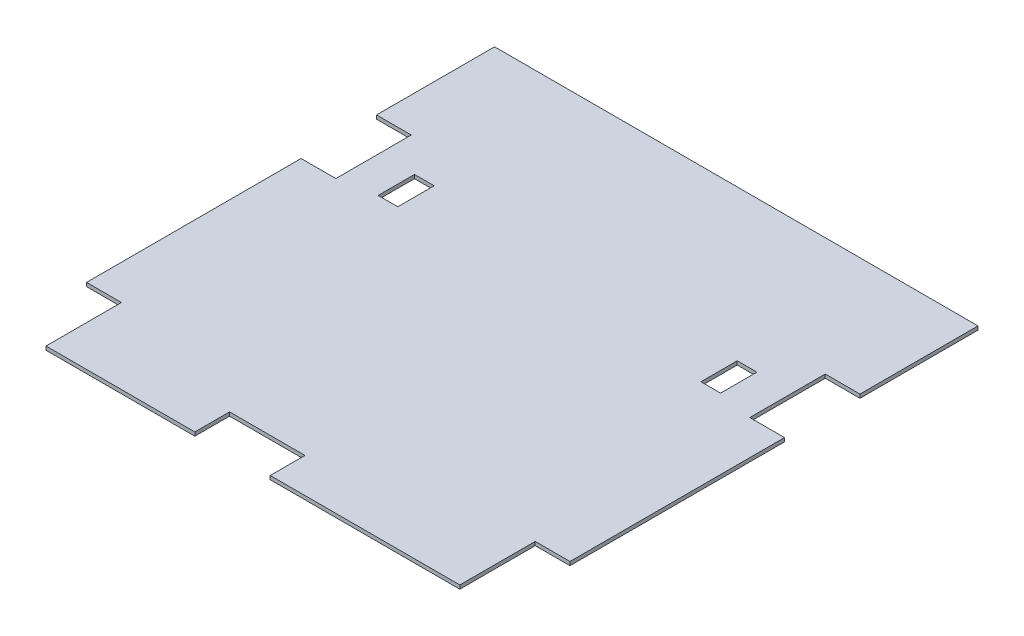
ISO-10303-21;
HEADER;
FILE_DESCRIPTION(('STEP AP214'),'2;1');
FILE_NAME('part.step','',(''),(''),'','','');
FILE_SCHEMA(('AUTOMOTIVE_DESIGN { 1 0 10303 214 1 1 1 1 }'));
ENDSEC;
DATA;
#1=APPLICATION_CONTEXT('core data for automotive mechanical design processes');
#2=APPLICATION_PROTOCOL_DEFINITION('international standard','automotive_design',2000,#1);
#3=PRODUCT_CONTEXT('',#1,'mechanical');
#4=PRODUCT('Part','Part','',(#3));
#5=PRODUCT_RELATED_PRODUCT_CATEGORY('part','',(#4));
#6=PRODUCT_DEFINITION_FORMATION('','',#4);
#7=PRODUCT_DEFINITION_CONTEXT('part definition',#1,'design');
#8=PRODUCT_DEFINITION('design','',#6,#7);
#9=PRODUCT_DEFINITION_SHAPE('','',#8);
#10=(LENGTH_UNIT() NAMED_UNIT(*) SI_UNIT(.MILLI.,.METRE.));
#11=(NAMED_UNIT(*) PLANE_ANGLE_UNIT() SI_UNIT($,.RADIAN.));
#12=(NAMED_UNIT(*) SI_UNIT($,.STERADIAN.) SOLID_ANGLE_UNIT());
#13=UNCERTAINTY_MEASURE_WITH_UNIT(LENGTH_MEASURE(1.E-05),#10,'distance_accuracy_value','');
#14=(GEOMETRIC_REPRESENTATION_CONTEXT(3) GLOBAL_UNCERTAINTY_ASSIGNED_CONTEXT((#13)) GLOBAL_UNIT_ASSIGNED_CONTEXT((#10,
#11,#12)) REPRESENTATION_CONTEXT('',''));
#15=CARTESIAN_POINT('',(0.,0.,0.));
#16=DIRECTION('',(0.,0.,1.));
#17=DIRECTION('',(1.,0.,0.));
#18=AXIS2_PLACEMENT_3D('',#15,#16,#17);
#19=CARTESIAN_POINT('',(0.,3.175,0.));
#20=DIRECTION('',(-1.,0.,0.));
#21=DIRECTION('',(0.,0.,1.));
#22=AXIS2_PLACEMENT_3D('',#19,#20,#21);
#23=PLANE('',#22);
#24=DIRECTION('',(0.,-1.,0.));
#25=VECTOR('',#24,1.);
#26=CARTESIAN_POINT('',(0.,3.175,-64.8999999999999));
#27=LINE('',#26,#25);
#28=CARTESIAN_POINT('',(0.,3.175,-64.8999999999999));
#29=VERTEX_POINT('',#28);
#30=CARTESIAN_POINT('',(0.,0.,-64.8999999999999));
#31=VERTEX_POINT('',#30);
#32=EDGE_CURVE('E315',#29,#31,#27,.T.);
#33=ORIENTED_EDGE('',*,*,#32,.F.);
#34=DIRECTION('',(0.,0.,-1.));
#35=VECTOR('',#34,1.);
#36=CARTESIAN_POINT('',(0.,3.175,0.));
#37=LINE('',#36,#35);
#38=CARTESIAN_POINT('',(0.,3.175,-249.58));
#39=VERTEX_POINT('',#38);
#40=EDGE_CURVE('E243',#29,#39,#37,.T.);
#41=ORIENTED_EDGE('',*,*,#40,.T.);
#42=DIRECTION('',(0.,-1.,0.));
#43=VECTOR('',#42,1.);
#44=CARTESIAN_POINT('',(0.,3.175,-249.58));
#45=LINE('',#44,#43);
#46=CARTESIAN_POINT('',(0.,0.,-249.58));
#47=VERTEX_POINT('',#46);
#48=EDGE_CURVE('E227',#39,#47,#45,.T.);
#49=ORIENTED_EDGE('',*,*,#48,.T.);
#50=DIRECTION('',(0.,0.,-1.));
#51=VECTOR('',#50,1.);
#52=CARTESIAN_POINT('',(0.,0.,0.));
#53=LINE('',#52,#51);
#54=EDGE_CURVE('E241',#31,#47,#53,.T.);
#55=ORIENTED_EDGE('',*,*,#54,.F.);
#56=EDGE_LOOP('',(#33,#41,#49,#55));
#57=FACE_BOUND('',#56,.T.);
#58=ADVANCED_FACE('F39',(#57),#23,.T.);
#59=CARTESIAN_POINT('',(0.,3.175,0.));
#60=DIRECTION('',(0.,0.,-1.));
#61=DIRECTION('',(-1.,0.,0.));
#62=AXIS2_PLACEMENT_3D('',#59,#60,#61);
#63=PLANE('',#62);
#64=DIRECTION('',(1.,0.,0.));
#65=VECTOR('',#64,1.);
#66=CARTESIAN_POINT('',(0.,0.,0.));
#67=LINE('',#66,#65);
#68=CARTESIAN_POINT('',(222.99,0.,0.));
#69=VERTEX_POINT('',#68);
#70=CARTESIAN_POINT('',(386.18,0.,0.));
#71=VERTEX_POINT('',#70);
#72=EDGE_CURVE('E260',#69,#71,#67,.T.);
#73=ORIENTED_EDGE('',*,*,#72,.T.);
#74=DIRECTION('',(0.,-1.,0.));
#75=VECTOR('',#74,1.);
#76=CARTESIAN_POINT('',(386.18,3.175,0.));
#77=LINE('',#76,#75);
#78=CARTESIAN_POINT('',(386.18,3.175,0.));
#79=VERTEX_POINT('',#78);
#80=EDGE_CURVE('E359',#79,#71,#77,.T.);
#81=ORIENTED_EDGE('',*,*,#80,.F.);
#82=DIRECTION('',(1.,0.,0.));
#83=VECTOR('',#82,1.);
#84=CARTESIAN_POINT('',(0.,3.175,0.));
#85=LINE('',#84,#83);
#86=CARTESIAN_POINT('',(222.99,3.175,0.));
#87=VERTEX_POINT('',#86);
#88=EDGE_CURVE('E273',#87,#79,#85,.T.);
#89=ORIENTED_EDGE('',*,*,#88,.F.);
#90=DIRECTION('',(0.,-1.,0.));
#91=VECTOR('',#90,1.);
#92=CARTESIAN_POINT('',(222.99,3.175,0.));
#93=LINE('',#92,#91);
#94=EDGE_CURVE('E336',#87,#69,#93,.T.);
#95=ORIENTED_EDGE('',*,*,#94,.T.);
#96=EDGE_LOOP('',(#73,#81,#89,#95));
#97=FACE_BOUND('',#96,.T.);
#98=ADVANCED_FACE('F484',(#97),#63,.F.);
#99=CARTESIAN_POINT('',(416.08,3.175,0.));
#100=DIRECTION('',(-1.,0.,0.));
#101=DIRECTION('',(0.,0.,1.));
#102=AXIS2_PLACEMENT_3D('',#99,#100,#101);
#103=PLANE('',#102);
#104=DIRECTION('',(0.,0.,-1.));
#105=VECTOR('',#104,1.);
#106=CARTESIAN_POINT('',(416.08,3.175,0.));
#107=LINE('',#106,#105);
#108=CARTESIAN_POINT('',(416.08,3.175,-314.48));
#109=VERTEX_POINT('',#108);
#110=CARTESIAN_POINT('',(416.08,3.175,-416.08));
#111=VERTEX_POINT('',#110);
#112=EDGE_CURVE('E256',#109,#111,#107,.T.);
#113=ORIENTED_EDGE('',*,*,#112,.F.);
#114=DIRECTION('',(0.,-1.,0.));
#115=VECTOR('',#114,1.);
#116=CARTESIAN_POINT('',(416.08,3.175,-314.48));
#117=LINE('',#116,#115);
#118=CARTESIAN_POINT('',(416.08,0.,-314.48));
#119=VERTEX_POINT('',#118);
#120=EDGE_CURVE('E415',#109,#119,#117,.T.);
#121=ORIENTED_EDGE('',*,*,#120,.T.);
#122=DIRECTION('',(0.,0.,-1.));
#123=VECTOR('',#122,1.);
#124=CARTESIAN_POINT('',(416.08,0.,0.));
#125=LINE('',#124,#123);
#126=CARTESIAN_POINT('',(416.08,0.,-416.08));
#127=VERTEX_POINT('',#126);
#128=EDGE_CURVE('E264',#119,#127,#125,.T.);
#129=ORIENTED_EDGE('',*,*,#128,.T.);
#130=DIRECTION('',(0.,-1.,0.));
#131=VECTOR('',#130,1.);
#132=CARTESIAN_POINT('',(416.08,3.175,-416.08));
#133=LINE('',#132,#131);
#134=EDGE_CURVE('E43',#111,#127,#133,.T.);
#135=ORIENTED_EDGE('',*,*,#134,.F.);
#136=EDGE_LOOP('',(#113,#121,#129,#135));
#137=FACE_BOUND('',#136,.T.);
#138=ADVANCED_FACE('F456',(#137),#103,.F.);
#139=CARTESIAN_POINT('',(0.,3.175,-416.08));
#140=DIRECTION('',(0.,0.,-1.));
#141=DIRECTION('',(-1.,0.,0.));
#142=AXIS2_PLACEMENT_3D('',#139,#140,#141);
#143=PLANE('',#142);
#144=DIRECTION('',(1.,0.,0.));
#145=VECTOR('',#144,1.);
#146=CARTESIAN_POINT('',(0.,0.,-416.08));
#147=LINE('',#146,#145);
#148=CARTESIAN_POINT('',(0.,0.,-416.08));
#149=VERTEX_POINT('',#148);
#150=EDGE_CURVE('E266',#149,#127,#147,.T.);
#151=ORIENTED_EDGE('',*,*,#150,.F.);
#152=DIRECTION('',(0.,-1.,0.));
#153=VECTOR('',#152,1.);
#154=CARTESIAN_POINT('',(0.,3.175,-416.08));
#155=LINE('',#154,#153);
#156=CARTESIAN_POINT('',(0.,3.175,-416.08));
#157=VERTEX_POINT('',#156);
#158=EDGE_CURVE('E11',#157,#149,#155,.T.);
#159=ORIENTED_EDGE('',*,*,#158,.F.);
#160=DIRECTION('',(1.,0.,0.));
#161=VECTOR('',#160,1.);
#162=CARTESIAN_POINT('',(0.,3.175,-416.08));
#163=LINE('',#162,#161);
#164=EDGE_CURVE('E252',#157,#111,#163,.T.);
#165=ORIENTED_EDGE('',*,*,#164,.T.);
#166=ORIENTED_EDGE('',*,*,#134,.T.);
#167=EDGE_LOOP('',(#151,#159,#165,#166));
#168=FACE_BOUND('',#167,.T.);
#169=ADVANCED_FACE('F41',(#168),#143,.T.);
#170=DIRECTION('',(0.,-1.,0.));
#171=VECTOR('',#170,1.);
#172=CARTESIAN_POINT('',(0.,3.175,-314.48));
#173=LINE('',#172,#171);
#174=CARTESIAN_POINT('',(0.,3.175,-314.48));
#175=VERTEX_POINT('',#174);
#176=CARTESIAN_POINT('',(0.,0.,-314.48));
#177=VERTEX_POINT('',#176);
#178=EDGE_CURVE('E430',#175,#177,#173,.T.);
#179=ORIENTED_EDGE('',*,*,#178,.F.);
#180=EDGE_CURVE('E270',#175,#157,#37,.T.);
#181=ORIENTED_EDGE('',*,*,#180,.T.);
#182=ORIENTED_EDGE('',*,*,#158,.T.);
#183=EDGE_CURVE('E253',#177,#149,#53,.T.);
#184=ORIENTED_EDGE('',*,*,#183,.F.);
#185=EDGE_LOOP('',(#179,#181,#182,#184));
#186=FACE_BOUND('',#185,.T.);
#187=ADVANCED_FACE('F444',(#186),#23,.T.);
#188=CARTESIAN_POINT('',(30.,0.,0.));
#189=VERTEX_POINT('',#188);
#190=CARTESIAN_POINT('',(158.09,0.,0.));
#191=VERTEX_POINT('',#190);
#192=EDGE_CURVE('E258',#189,#191,#67,.T.);
#193=ORIENTED_EDGE('',*,*,#192,.T.);
#194=DIRECTION('',(0.,-1.,0.));
#195=VECTOR('',#194,1.);
#196=CARTESIAN_POINT('',(158.09,3.175,0.));
#197=LINE('',#196,#195);
#198=CARTESIAN_POINT('',(158.09,3.175,0.));
#199=VERTEX_POINT('',#198);
#200=EDGE_CURVE('E348',#199,#191,#197,.T.);
#201=ORIENTED_EDGE('',*,*,#200,.F.);
#202=CARTESIAN_POINT('',(30.,3.175,0.));
#203=VERTEX_POINT('',#202);
#204=EDGE_CURVE('E272',#203,#199,#85,.T.);
#205=ORIENTED_EDGE('',*,*,#204,.F.);
#206=DIRECTION('',(0.,-1.,0.));
#207=VECTOR('',#206,1.);
#208=CARTESIAN_POINT('',(30.,3.175,0.));
#209=LINE('',#208,#207);
#210=EDGE_CURVE('E319',#203,#189,#209,.T.);
#211=ORIENTED_EDGE('',*,*,#210,.T.);
#212=EDGE_LOOP('',(#193,#201,#205,#211));
#213=FACE_BOUND('',#212,.T.);
#214=ADVANCED_FACE('F501',(#213),#63,.F.);
#215=CARTESIAN_POINT('',(416.08,3.175,-64.8999999999999));
#216=VERTEX_POINT('',#215);
#217=CARTESIAN_POINT('',(416.08,3.175,-249.58));
#218=VERTEX_POINT('',#217);
#219=EDGE_CURVE('E276',#216,#218,#107,.T.);
#220=ORIENTED_EDGE('',*,*,#219,.F.);
#221=DIRECTION('',(0.,-1.,0.));
#222=VECTOR('',#221,1.);
#223=CARTESIAN_POINT('',(416.08,3.175,-64.8999999999999));
#224=LINE('',#223,#222);
#225=CARTESIAN_POINT('',(416.08,0.,-64.8999999999999));
#226=VERTEX_POINT('',#225);
#227=EDGE_CURVE('E339',#216,#226,#224,.T.);
#228=ORIENTED_EDGE('',*,*,#227,.T.);
#229=CARTESIAN_POINT('',(416.08,0.,-249.58));
#230=VERTEX_POINT('',#229);
#231=EDGE_CURVE('E263',#226,#230,#125,.T.);
#232=ORIENTED_EDGE('',*,*,#231,.T.);
#233=DIRECTION('',(0.,-1.,0.));
#234=VECTOR('',#233,1.);
#235=CARTESIAN_POINT('',(416.08,3.175,-249.58));
#236=LINE('',#235,#234);
#237=EDGE_CURVE('E408',#218,#230,#236,.T.);
#238=ORIENTED_EDGE('',*,*,#237,.F.);
#239=EDGE_LOOP('',(#220,#228,#232,#238));
#240=FACE_BOUND('',#239,.T.);
#241=ADVANCED_FACE('F474',(#240),#103,.F.);
#242=CARTESIAN_POINT('',(0.,3.175,0.));
#243=DIRECTION('',(0.,1.,0.));
#244=DIRECTION('',(0.,0.,1.));
#245=AXIS2_PLACEMENT_3D('',#242,#243,#244);
#246=PLANE('',#245);
#247=DIRECTION('',(0.,0.,1.));
#248=VECTOR('',#247,1.);
#249=CARTESIAN_POINT('',(355.398114974862,3.175,-255.205234024173));
#250=LINE('',#249,#248);
#251=CARTESIAN_POINT('',(355.398114974862,3.175,-286.464232730795));
#252=VERTEX_POINT('',#251);
#253=CARTESIAN_POINT('',(355.398114974862,3.175,-255.205234024173));
#254=VERTEX_POINT('',#253);
#255=EDGE_CURVE('E370',#252,#254,#250,.T.);
#256=ORIENTED_EDGE('',*,*,#255,.T.);
#257=DIRECTION('',(-1.,0.,0.));
#258=VECTOR('',#257,1.);
#259=CARTESIAN_POINT('',(355.398114974862,3.175,-255.205234024173));
#260=LINE('',#259,#258);
#261=CARTESIAN_POINT('',(338.483807993559,3.175,-255.205234024173));
#262=VERTEX_POINT('',#261);
#263=EDGE_CURVE('E374',#254,#262,#260,.T.);
#264=ORIENTED_EDGE('',*,*,#263,.T.);
#265=DIRECTION('',(0.,0.,-1.));
#266=VECTOR('',#265,1.);
#267=CARTESIAN_POINT('',(338.483807993559,3.175,-255.205234024173));
#268=LINE('',#267,#266);
#269=CARTESIAN_POINT('',(338.483807993559,3.175,-286.464232730795));
#270=VERTEX_POINT('',#269);
#271=EDGE_CURVE('E54',#262,#270,#268,.T.);
#272=ORIENTED_EDGE('',*,*,#271,.T.);
#273=DIRECTION('',(1.,0.,0.));
#274=VECTOR('',#273,1.);
#275=CARTESIAN_POINT('',(355.398114974862,3.175,-286.464232730795));
#276=LINE('',#275,#274);
#277=EDGE_CURVE('E378',#270,#252,#276,.T.);
#278=ORIENTED_EDGE('',*,*,#277,.T.);
#279=EDGE_LOOP('',(#256,#264,#272,#278));
#280=FACE_BOUND('',#279,.T.);
#281=DIRECTION('',(1.,0.,0.));
#282=VECTOR('',#281,1.);
#283=CARTESIAN_POINT('',(416.08,3.175,-64.8999999999999));
#284=LINE('',#283,#282);
#285=CARTESIAN_POINT('',(386.18,3.175,-64.8999999999999));
#286=VERTEX_POINT('',#285);
#287=EDGE_CURVE('E356',#286,#216,#284,.T.);
#288=ORIENTED_EDGE('',*,*,#287,.T.);
#289=ORIENTED_EDGE('',*,*,#219,.T.);
#290=DIRECTION('',(-1.,0.,0.));
#291=VECTOR('',#290,1.);
#292=CARTESIAN_POINT('',(416.08,3.175,-249.58));
#293=LINE('',#292,#291);
#294=CARTESIAN_POINT('',(386.18,3.175,-249.58));
#295=VERTEX_POINT('',#294);
#296=EDGE_CURVE('E398',#218,#295,#293,.T.);
#297=ORIENTED_EDGE('',*,*,#296,.T.);
#298=DIRECTION('',(0.,0.,-1.));
#299=VECTOR('',#298,1.);
#300=CARTESIAN_POINT('',(386.18,3.175,-249.58));
#301=LINE('',#300,#299);
#302=CARTESIAN_POINT('',(386.18,3.175,-314.48));
#303=VERTEX_POINT('',#302);
#304=EDGE_CURVE('E402',#295,#303,#301,.T.);
#305=ORIENTED_EDGE('',*,*,#304,.T.);
#306=DIRECTION('',(1.,0.,0.));
#307=VECTOR('',#306,1.);
#308=CARTESIAN_POINT('',(416.08,3.175,-314.48));
#309=LINE('',#308,#307);
#310=EDGE_CURVE('E405',#303,#109,#309,.T.);
#311=ORIENTED_EDGE('',*,*,#310,.T.);
#312=ORIENTED_EDGE('',*,*,#112,.T.);
#313=ORIENTED_EDGE('',*,*,#164,.F.);
#314=ORIENTED_EDGE('',*,*,#180,.F.);
#315=DIRECTION('',(1.,0.,0.));
#316=VECTOR('',#315,1.);
#317=CARTESIAN_POINT('',(0.,3.175,-314.48));
#318=LINE('',#317,#316);
#319=CARTESIAN_POINT('',(29.9,3.175,-314.48));
#320=VERTEX_POINT('',#319);
#321=EDGE_CURVE('E235',#175,#320,#318,.T.);
#322=ORIENTED_EDGE('',*,*,#321,.T.);
#323=DIRECTION('',(0.,0.,1.));
#324=VECTOR('',#323,1.);
#325=CARTESIAN_POINT('',(29.9,3.175,-314.48));
#326=LINE('',#325,#324);
#327=CARTESIAN_POINT('',(29.9,3.175,-249.58));
#328=VERTEX_POINT('',#327);
#329=EDGE_CURVE('E425',#320,#328,#326,.T.);
#330=ORIENTED_EDGE('',*,*,#329,.T.);
#331=DIRECTION('',(-1.,0.,0.));
#332=VECTOR('',#331,1.);
#333=CARTESIAN_POINT('',(0.,3.175,-249.58));
#334=LINE('',#333,#332);
#335=EDGE_CURVE('E428',#328,#39,#334,.T.);
#336=ORIENTED_EDGE('',*,*,#335,.T.);
#337=ORIENTED_EDGE('',*,*,#40,.F.);
#338=DIRECTION('',(1.,0.,0.));
#339=VECTOR('',#338,1.);
#340=CARTESIAN_POINT('',(0.,3.175,-64.8999999999999));
#341=LINE('',#340,#339);
#342=CARTESIAN_POINT('',(30.,3.175,-64.8999999999999));
#343=VERTEX_POINT('',#342);
#344=EDGE_CURVE('E308',#29,#343,#341,.T.);
#345=ORIENTED_EDGE('',*,*,#344,.T.);
#346=DIRECTION('',(0.,0.,1.));
#347=VECTOR('',#346,1.);
#348=CARTESIAN_POINT('',(30.,3.175,0.));
#349=LINE('',#348,#347);
#350=EDGE_CURVE('E312',#343,#203,#349,.T.);
#351=ORIENTED_EDGE('',*,*,#350,.T.);
#352=ORIENTED_EDGE('',*,*,#204,.T.);
#353=DIRECTION('',(0.,0.,-1.));
#354=VECTOR('',#353,1.);
#355=CARTESIAN_POINT('',(158.09,3.175,-29.9));
#356=LINE('',#355,#354);
#357=CARTESIAN_POINT('',(158.09,3.175,-29.9));
#358=VERTEX_POINT('',#357);
#359=EDGE_CURVE('E330',#199,#358,#356,.T.);
#360=ORIENTED_EDGE('',*,*,#359,.T.);
#361=DIRECTION('',(1.,0.,0.));
#362=VECTOR('',#361,1.);
#363=CARTESIAN_POINT('',(222.99,3.175,-29.9));
#364=LINE('',#363,#362);
#365=CARTESIAN_POINT('',(222.99,3.175,-29.9));
#366=VERTEX_POINT('',#365);
#367=EDGE_CURVE('E333',#358,#366,#364,.T.);
#368=ORIENTED_EDGE('',*,*,#367,.T.);
#369=DIRECTION('',(0.,0.,1.));
#370=VECTOR('',#369,1.);
#371=CARTESIAN_POINT('',(222.99,3.175,-29.9));
#372=LINE('',#371,#370);
#373=EDGE_CURVE('E326',#366,#87,#372,.T.);
#374=ORIENTED_EDGE('',*,*,#373,.T.);
#375=ORIENTED_EDGE('',*,*,#88,.T.);
#376=DIRECTION('',(0.,0.,-1.));
#377=VECTOR('',#376,1.);
#378=CARTESIAN_POINT('',(386.18,3.175,0.));
#379=LINE('',#378,#377);
#380=EDGE_CURVE('E352',#79,#286,#379,.T.);
#381=ORIENTED_EDGE('',*,*,#380,.T.);
#382=EDGE_LOOP('',(#288,#289,#297,#305,#311,#312,#313,#314,#322,#330,#336,#337,#345,#351,#352,
#360,#368,#374,#375,#381));
#383=FACE_BOUND('',#382,.T.);
#384=DIRECTION('',(0.,0.,1.));
#385=VECTOR('',#384,1.);
#386=CARTESIAN_POINT('',(77.5961920064408,3.175,-255.205234024173));
#387=LINE('',#386,#385);
#388=CARTESIAN_POINT('',(77.5961920064408,3.175,-286.464232730795));
#389=VERTEX_POINT('',#388);
#390=CARTESIAN_POINT('',(77.5961920064408,3.175,-255.205234024173));
#391=VERTEX_POINT('',#390);
#392=EDGE_CURVE('E290',#389,#391,#387,.T.);
#393=ORIENTED_EDGE('',*,*,#392,.T.);
#394=DIRECTION('',(-1.,0.,0.));
#395=VECTOR('',#394,1.);
#396=CARTESIAN_POINT('',(60.6818850251383,3.175,-255.205234024173));
#397=LINE('',#396,#395);
#398=CARTESIAN_POINT('',(60.6818850251383,3.175,-255.205234024173));
#399=VERTEX_POINT('',#398);
#400=EDGE_CURVE('E303',#391,#399,#397,.T.);
#401=ORIENTED_EDGE('',*,*,#400,.T.);
#402=DIRECTION('',(0.,0.,-1.));
#403=VECTOR('',#402,1.);
#404=CARTESIAN_POINT('',(60.6818850251383,3.175,-255.205234024173));
#405=LINE('',#404,#403);
#406=CARTESIAN_POINT('',(60.6818850251383,3.175,-286.464232730795));
#407=VERTEX_POINT('',#406);
#408=EDGE_CURVE('E62',#399,#407,#405,.T.);
#409=ORIENTED_EDGE('',*,*,#408,.T.);
#410=DIRECTION('',(1.,0.,0.));
#411=VECTOR('',#410,1.);
#412=CARTESIAN_POINT('',(60.6818850251383,3.175,-286.464232730795));
#413=LINE('',#412,#411);
#414=EDGE_CURVE('E282',#407,#389,#413,.T.);
#415=ORIENTED_EDGE('',*,*,#414,.T.);
#416=EDGE_LOOP('',(#393,#401,#409,#415));
#417=FACE_BOUND('',#416,.T.);
#418=ADVANCED_FACE('F461',(#280,#383,#417),#246,.T.);
#419=CARTESIAN_POINT('',(0.,0.,0.));
#420=DIRECTION('',(0.,1.,0.));
#421=DIRECTION('',(0.,0.,1.));
#422=AXIS2_PLACEMENT_3D('',#419,#420,#421);
#423=PLANE('',#422);
#424=DIRECTION('',(-1.,0.,0.));
#425=VECTOR('',#424,1.);
#426=CARTESIAN_POINT('',(355.398114974862,0.,-255.205234024173));
#427=LINE('',#426,#425);
#428=CARTESIAN_POINT('',(355.398114974862,0.,-255.205234024173));
#429=VERTEX_POINT('',#428);
#430=CARTESIAN_POINT('',(338.483807993559,0.,-255.205234024173));
#431=VERTEX_POINT('',#430);
#432=EDGE_CURVE('E383',#429,#431,#427,.T.);
#433=ORIENTED_EDGE('',*,*,#432,.F.);
#434=DIRECTION('',(0.,0.,1.));
#435=VECTOR('',#434,1.);
#436=CARTESIAN_POINT('',(355.398114974862,0.,-255.205234024173));
#437=LINE('',#436,#435);
#438=CARTESIAN_POINT('',(355.398114974862,0.,-286.464232730795));
#439=VERTEX_POINT('',#438);
#440=EDGE_CURVE('E299',#439,#429,#437,.T.);
#441=ORIENTED_EDGE('',*,*,#440,.F.);
#442=DIRECTION('',(1.,0.,0.));
#443=VECTOR('',#442,1.);
#444=CARTESIAN_POINT('',(355.398114974862,0.,-286.464232730795));
#445=LINE('',#444,#443);
#446=CARTESIAN_POINT('',(338.483807993559,0.,-286.464232730795));
#447=VERTEX_POINT('',#446);
#448=EDGE_CURVE('E373',#447,#439,#445,.T.);
#449=ORIENTED_EDGE('',*,*,#448,.F.);
#450=DIRECTION('',(0.,0.,-1.));
#451=VECTOR('',#450,1.);
#452=CARTESIAN_POINT('',(338.483807993559,0.,-255.205234024173));
#453=LINE('',#452,#451);
#454=EDGE_CURVE('E386',#431,#447,#453,.T.);
#455=ORIENTED_EDGE('',*,*,#454,.F.);
#456=EDGE_LOOP('',(#433,#441,#449,#455));
#457=FACE_BOUND('',#456,.T.);
#458=DIRECTION('',(-1.,0.,0.));
#459=VECTOR('',#458,1.);
#460=CARTESIAN_POINT('',(60.6818850251383,0.,-255.205234024173));
#461=LINE('',#460,#459);
#462=CARTESIAN_POINT('',(77.5961920064408,0.,-255.205234024173));
#463=VERTEX_POINT('',#462);
#464=CARTESIAN_POINT('',(60.6818850251383,0.,-255.205234024173));
#465=VERTEX_POINT('',#464);
#466=EDGE_CURVE('E294',#463,#465,#461,.T.);
#467=ORIENTED_EDGE('',*,*,#466,.F.);
#468=DIRECTION('',(0.,0.,1.));
#469=VECTOR('',#468,1.);
#470=CARTESIAN_POINT('',(77.5961920064408,0.,-255.205234024173));
#471=LINE('',#470,#469);
#472=CARTESIAN_POINT('',(77.5961920064408,0.,-286.464232730795));
#473=VERTEX_POINT('',#472);
#474=EDGE_CURVE('E297',#473,#463,#471,.T.);
#475=ORIENTED_EDGE('',*,*,#474,.F.);
#476=DIRECTION('',(1.,0.,0.));
#477=VECTOR('',#476,1.);
#478=CARTESIAN_POINT('',(60.6818850251383,0.,-286.464232730795));
#479=LINE('',#478,#477);
#480=CARTESIAN_POINT('',(60.6818850251383,0.,-286.464232730795));
#481=VERTEX_POINT('',#480);
#482=EDGE_CURVE('E287',#481,#473,#479,.T.);
#483=ORIENTED_EDGE('',*,*,#482,.F.);
#484=DIRECTION('',(0.,0.,-1.));
#485=VECTOR('',#484,1.);
#486=CARTESIAN_POINT('',(60.6818850251383,0.,-255.205234024173));
#487=LINE('',#486,#485);
#488=EDGE_CURVE('E291',#465,#481,#487,.T.);
#489=ORIENTED_EDGE('',*,*,#488,.F.);
#490=EDGE_LOOP('',(#467,#475,#483,#489));
#491=FACE_BOUND('',#490,.T.);
#492=ORIENTED_EDGE('',*,*,#231,.F.);
#493=DIRECTION('',(1.,0.,0.));
#494=VECTOR('',#493,1.);
#495=CARTESIAN_POINT('',(416.08,0.,-64.8999999999999));
#496=LINE('',#495,#494);
#497=CARTESIAN_POINT('',(386.18,0.,-64.8999999999999));
#498=VERTEX_POINT('',#497);
#499=EDGE_CURVE('E355',#498,#226,#496,.T.);
#500=ORIENTED_EDGE('',*,*,#499,.F.);
#501=DIRECTION('',(0.,0.,-1.));
#502=VECTOR('',#501,1.);
#503=CARTESIAN_POINT('',(386.18,0.,0.));
#504=LINE('',#503,#502);
#505=EDGE_CURVE('E360',#71,#498,#504,.T.);
#506=ORIENTED_EDGE('',*,*,#505,.F.);
#507=ORIENTED_EDGE('',*,*,#72,.F.);
#508=DIRECTION('',(0.,0.,1.));
#509=VECTOR('',#508,1.);
#510=CARTESIAN_POINT('',(222.99,0.,-29.9));
#511=LINE('',#510,#509);
#512=CARTESIAN_POINT('',(222.99,0.,-29.9));
#513=VERTEX_POINT('',#512);
#514=EDGE_CURVE('E337',#513,#69,#511,.T.);
#515=ORIENTED_EDGE('',*,*,#514,.F.);
#516=DIRECTION('',(1.,0.,0.));
#517=VECTOR('',#516,1.);
#518=CARTESIAN_POINT('',(222.99,0.,-29.9));
#519=LINE('',#518,#517);
#520=CARTESIAN_POINT('',(158.09,0.,-29.9));
#521=VERTEX_POINT('',#520);
#522=EDGE_CURVE('E329',#521,#513,#519,.T.);
#523=ORIENTED_EDGE('',*,*,#522,.F.);
#524=DIRECTION('',(0.,0.,-1.));
#525=VECTOR('',#524,1.);
#526=CARTESIAN_POINT('',(158.09,0.,-29.9));
#527=LINE('',#526,#525);
#528=EDGE_CURVE('E340',#191,#521,#527,.T.);
#529=ORIENTED_EDGE('',*,*,#528,.F.);
#530=ORIENTED_EDGE('',*,*,#192,.F.);
#531=DIRECTION('',(0.,0.,1.));
#532=VECTOR('',#531,1.);
#533=CARTESIAN_POINT('',(30.,0.,0.));
#534=LINE('',#533,#532);
#535=CARTESIAN_POINT('',(30.,0.,-64.8999999999999));
#536=VERTEX_POINT('',#535);
#537=EDGE_CURVE('E311',#536,#189,#534,.T.);
#538=ORIENTED_EDGE('',*,*,#537,.F.);
#539=DIRECTION('',(1.,0.,0.));
#540=VECTOR('',#539,1.);
#541=CARTESIAN_POINT('',(0.,0.,-64.8999999999999));
#542=LINE('',#541,#540);
#543=EDGE_CURVE('E251',#31,#536,#542,.T.);
#544=ORIENTED_EDGE('',*,*,#543,.F.);
#545=ORIENTED_EDGE('',*,*,#54,.T.);
#546=DIRECTION('',(-1.,0.,0.));
#547=VECTOR('',#546,1.);
#548=CARTESIAN_POINT('',(0.,0.,-249.58));
#549=LINE('',#548,#547);
#550=CARTESIAN_POINT('',(29.9,0.,-249.58));
#551=VERTEX_POINT('',#550);
#552=EDGE_CURVE('E223',#551,#47,#549,.T.);
#553=ORIENTED_EDGE('',*,*,#552,.F.);
#554=DIRECTION('',(0.,0.,1.));
#555=VECTOR('',#554,1.);
#556=CARTESIAN_POINT('',(29.9,0.,-314.48));
#557=LINE('',#556,#555);
#558=CARTESIAN_POINT('',(29.9,0.,-314.48));
#559=VERTEX_POINT('',#558);
#560=EDGE_CURVE('E234',#559,#551,#557,.T.);
#561=ORIENTED_EDGE('',*,*,#560,.F.);
#562=DIRECTION('',(1.,0.,0.));
#563=VECTOR('',#562,1.);
#564=CARTESIAN_POINT('',(0.,0.,-314.48));
#565=LINE('',#564,#563);
#566=EDGE_CURVE('E323',#177,#559,#565,.T.);
#567=ORIENTED_EDGE('',*,*,#566,.F.);
#568=ORIENTED_EDGE('',*,*,#183,.T.);
#569=ORIENTED_EDGE('',*,*,#150,.T.);
#570=ORIENTED_EDGE('',*,*,#128,.F.);
#571=DIRECTION('',(1.,0.,0.));
#572=VECTOR('',#571,1.);
#573=CARTESIAN_POINT('',(416.08,0.,-314.48));
#574=LINE('',#573,#572);
#575=CARTESIAN_POINT('',(386.18,0.,-314.48));
#576=VERTEX_POINT('',#575);
#577=EDGE_CURVE('E401',#576,#119,#574,.T.);
#578=ORIENTED_EDGE('',*,*,#577,.F.);
#579=DIRECTION('',(0.,0.,-1.));
#580=VECTOR('',#579,1.);
#581=CARTESIAN_POINT('',(386.18,0.,-249.58));
#582=LINE('',#581,#580);
#583=CARTESIAN_POINT('',(386.18,0.,-249.58));
#584=VERTEX_POINT('',#583);
#585=EDGE_CURVE('E411',#584,#576,#582,.T.);
#586=ORIENTED_EDGE('',*,*,#585,.F.);
#587=DIRECTION('',(-1.,0.,0.));
#588=VECTOR('',#587,1.);
#589=CARTESIAN_POINT('',(416.08,0.,-249.58));
#590=LINE('',#589,#588);
#591=EDGE_CURVE('E244',#230,#584,#590,.T.);
#592=ORIENTED_EDGE('',*,*,#591,.F.);
#593=EDGE_LOOP('',(#492,#500,#506,#507,#515,#523,#529,#530,#538,#544,#545,#553,#561,#567,#568,
#569,#570,#578,#586,#592));
#594=FACE_BOUND('',#593,.T.);
#595=ADVANCED_FACE('F248',(#457,#491,#594),#423,.F.);
#596=CARTESIAN_POINT('',(77.5961920064408,3.175,-255.205234024173));
#597=DIRECTION('',(1.,0.,0.));
#598=DIRECTION('',(0.,0.,-1.));
#599=AXIS2_PLACEMENT_3D('',#596,#597,#598);
#600=PLANE('',#599);
#601=ORIENTED_EDGE('',*,*,#474,.T.);
#602=DIRECTION('',(0.,-1.,0.));
#603=VECTOR('',#602,1.);
#604=CARTESIAN_POINT('',(77.5961920064408,3.175,-255.205234024173));
#605=LINE('',#604,#603);
#606=EDGE_CURVE('E278',#391,#463,#605,.T.);
#607=ORIENTED_EDGE('',*,*,#606,.F.);
#608=ORIENTED_EDGE('',*,*,#392,.F.);
#609=DIRECTION('',(0.,-1.,0.));
#610=VECTOR('',#609,1.);
#611=CARTESIAN_POINT('',(77.5961920064408,3.175,-286.464232730795));
#612=LINE('',#611,#610);
#613=EDGE_CURVE('E269',#389,#473,#612,.T.);
#614=ORIENTED_EDGE('',*,*,#613,.T.);
#615=EDGE_LOOP('',(#601,#607,#608,#614));
#616=FACE_BOUND('',#615,.T.);
#617=ADVANCED_FACE('F544',(#616),#600,.F.);
#618=CARTESIAN_POINT('',(60.6818850251383,3.175,-286.464232730795));
#619=DIRECTION('',(0.,0.,-1.));
#620=DIRECTION('',(-1.,0.,0.));
#621=AXIS2_PLACEMENT_3D('',#618,#619,#620);
#622=PLANE('',#621);
#623=ORIENTED_EDGE('',*,*,#482,.T.);
#624=ORIENTED_EDGE('',*,*,#613,.F.);
#625=ORIENTED_EDGE('',*,*,#414,.F.);
#626=DIRECTION('',(0.,-1.,0.));
#627=VECTOR('',#626,1.);
#628=CARTESIAN_POINT('',(60.6818850251383,3.175,-286.464232730795));
#629=LINE('',#628,#627);
#630=EDGE_CURVE('E284',#407,#481,#629,.T.);
#631=ORIENTED_EDGE('',*,*,#630,.T.);
#632=EDGE_LOOP('',(#623,#624,#625,#631));
#633=FACE_BOUND('',#632,.T.);
#634=ADVANCED_FACE('F549',(#633),#622,.F.);
#635=CARTESIAN_POINT('',(60.6818850251383,3.175,-255.205234024173));
#636=DIRECTION('',(-1.,0.,0.));
#637=DIRECTION('',(0.,0.,1.));
#638=AXIS2_PLACEMENT_3D('',#635,#636,#637);
#639=PLANE('',#638);
#640=ORIENTED_EDGE('',*,*,#488,.T.);
#641=ORIENTED_EDGE('',*,*,#630,.F.);
#642=ORIENTED_EDGE('',*,*,#408,.F.);
#643=DIRECTION('',(0.,-1.,0.));
#644=VECTOR('',#643,1.);
#645=CARTESIAN_POINT('',(60.6818850251383,3.175,-255.205234024173));
#646=LINE('',#645,#644);
#647=EDGE_CURVE('E281',#399,#465,#646,.T.);
#648=ORIENTED_EDGE('',*,*,#647,.T.);
#649=EDGE_LOOP('',(#640,#641,#642,#648));
#650=FACE_BOUND('',#649,.T.);
#651=ADVANCED_FACE('F554',(#650),#639,.F.);
#652=CARTESIAN_POINT('',(60.6818850251383,3.175,-255.205234024173));
#653=DIRECTION('',(0.,0.,1.));
#654=DIRECTION('',(1.,0.,0.));
#655=AXIS2_PLACEMENT_3D('',#652,#653,#654);
#656=PLANE('',#655);
#657=ORIENTED_EDGE('',*,*,#466,.T.);
#658=ORIENTED_EDGE('',*,*,#647,.F.);
#659=ORIENTED_EDGE('',*,*,#400,.F.);
#660=ORIENTED_EDGE('',*,*,#606,.T.);
#661=EDGE_LOOP('',(#657,#658,#659,#660));
#662=FACE_BOUND('',#661,.T.);
#663=ADVANCED_FACE('F551',(#662),#656,.F.);
#664=CARTESIAN_POINT('',(416.08,3.175,-314.48));
#665=DIRECTION('',(0.,0.,-1.));
#666=DIRECTION('',(-1.,0.,0.));
#667=AXIS2_PLACEMENT_3D('',#664,#665,#666);
#668=PLANE('',#667);
#669=ORIENTED_EDGE('',*,*,#577,.T.);
#670=ORIENTED_EDGE('',*,*,#120,.F.);
#671=ORIENTED_EDGE('',*,*,#310,.F.);
#672=DIRECTION('',(0.,-1.,0.));
#673=VECTOR('',#672,1.);
#674=CARTESIAN_POINT('',(386.18,3.175,-314.48));
#675=LINE('',#674,#673);
#676=EDGE_CURVE('E418',#303,#576,#675,.T.);
#677=ORIENTED_EDGE('',*,*,#676,.T.);
#678=EDGE_LOOP('',(#669,#670,#671,#677));
#679=FACE_BOUND('',#678,.T.);
#680=ADVANCED_FACE('F459',(#679),#668,.F.);
#681=CARTESIAN_POINT('',(386.18,3.175,-249.58));
#682=DIRECTION('',(-1.,0.,0.));
#683=DIRECTION('',(0.,0.,1.));
#684=AXIS2_PLACEMENT_3D('',#681,#682,#683);
#685=PLANE('',#684);
#686=ORIENTED_EDGE('',*,*,#585,.T.);
#687=ORIENTED_EDGE('',*,*,#676,.F.);
#688=ORIENTED_EDGE('',*,*,#304,.F.);
#689=DIRECTION('',(0.,-1.,0.));
#690=VECTOR('',#689,1.);
#691=CARTESIAN_POINT('',(386.18,3.175,-249.58));
#692=LINE('',#691,#690);
#693=EDGE_CURVE('E420',#295,#584,#692,.T.);
#694=ORIENTED_EDGE('',*,*,#693,.T.);
#695=EDGE_LOOP('',(#686,#687,#688,#694));
#696=FACE_BOUND('',#695,.T.);
#697=ADVANCED_FACE('F466',(#696),#685,.F.);
#698=CARTESIAN_POINT('',(416.08,3.175,-249.58));
#699=DIRECTION('',(0.,0.,1.));
#700=DIRECTION('',(1.,0.,0.));
#701=AXIS2_PLACEMENT_3D('',#698,#699,#700);
#702=PLANE('',#701);
#703=ORIENTED_EDGE('',*,*,#591,.T.);
#704=ORIENTED_EDGE('',*,*,#693,.F.);
#705=ORIENTED_EDGE('',*,*,#296,.F.);
#706=ORIENTED_EDGE('',*,*,#237,.T.);
#707=EDGE_LOOP('',(#703,#704,#705,#706));
#708=FACE_BOUND('',#707,.T.);
#709=ADVANCED_FACE('F596',(#708),#702,.F.);
#710=CARTESIAN_POINT('',(0.,3.175,-249.58));
#711=DIRECTION('',(0.,0.,1.));
#712=DIRECTION('',(1.,0.,0.));
#713=AXIS2_PLACEMENT_3D('',#710,#711,#712);
#714=PLANE('',#713);
#715=ORIENTED_EDGE('',*,*,#552,.T.);
#716=ORIENTED_EDGE('',*,*,#48,.F.);
#717=ORIENTED_EDGE('',*,*,#335,.F.);
#718=DIRECTION('',(0.,-1.,0.));
#719=VECTOR('',#718,1.);
#720=CARTESIAN_POINT('',(29.9,3.175,-249.58));
#721=LINE('',#720,#719);
#722=EDGE_CURVE('E229',#328,#551,#721,.T.);
#723=ORIENTED_EDGE('',*,*,#722,.T.);
#724=EDGE_LOOP('',(#715,#716,#717,#723));
#725=FACE_BOUND('',#724,.T.);
#726=ADVANCED_FACE('F225',(#725),#714,.F.);
#727=CARTESIAN_POINT('',(29.9,3.175,-314.48));
#728=DIRECTION('',(1.,0.,0.));
#729=DIRECTION('',(0.,0.,-1.));
#730=AXIS2_PLACEMENT_3D('',#727,#728,#729);
#731=PLANE('',#730);
#732=ORIENTED_EDGE('',*,*,#560,.T.);
#733=ORIENTED_EDGE('',*,*,#722,.F.);
#734=ORIENTED_EDGE('',*,*,#329,.F.);
#735=DIRECTION('',(0.,-1.,0.));
#736=VECTOR('',#735,1.);
#737=CARTESIAN_POINT('',(29.9,3.175,-314.48));
#738=LINE('',#737,#736);
#739=EDGE_CURVE('E435',#320,#559,#738,.T.);
#740=ORIENTED_EDGE('',*,*,#739,.T.);
#741=EDGE_LOOP('',(#732,#733,#734,#740));
#742=FACE_BOUND('',#741,.T.);
#743=ADVANCED_FACE('F611',(#742),#731,.F.);
#744=CARTESIAN_POINT('',(0.,3.175,-314.48));
#745=DIRECTION('',(0.,0.,-1.));
#746=DIRECTION('',(-1.,0.,0.));
#747=AXIS2_PLACEMENT_3D('',#744,#745,#746);
#748=PLANE('',#747);
#749=ORIENTED_EDGE('',*,*,#566,.T.);
#750=ORIENTED_EDGE('',*,*,#739,.F.);
#751=ORIENTED_EDGE('',*,*,#321,.F.);
#752=ORIENTED_EDGE('',*,*,#178,.T.);
#753=EDGE_LOOP('',(#749,#750,#751,#752));
#754=FACE_BOUND('',#753,.T.);
#755=ADVANCED_FACE('F440',(#754),#748,.F.);
#756=CARTESIAN_POINT('',(30.,3.175,0.));
#757=DIRECTION('',(1.,0.,0.));
#758=DIRECTION('',(0.,0.,-1.));
#759=AXIS2_PLACEMENT_3D('',#756,#757,#758);
#760=PLANE('',#759);
#761=ORIENTED_EDGE('',*,*,#537,.T.);
#762=ORIENTED_EDGE('',*,*,#210,.F.);
#763=ORIENTED_EDGE('',*,*,#350,.F.);
#764=DIRECTION('',(0.,-1.,0.));
#765=VECTOR('',#764,1.);
#766=CARTESIAN_POINT('',(30.,3.175,-64.8999999999999));
#767=LINE('',#766,#765);
#768=EDGE_CURVE('E322',#343,#536,#767,.T.);
#769=ORIENTED_EDGE('',*,*,#768,.T.);
#770=EDGE_LOOP('',(#761,#762,#763,#769));
#771=FACE_BOUND('',#770,.T.);
#772=ADVANCED_FACE('F506',(#771),#760,.F.);
#773=CARTESIAN_POINT('',(0.,3.175,-64.8999999999999));
#774=DIRECTION('',(0.,0.,-1.));
#775=DIRECTION('',(-1.,0.,0.));
#776=AXIS2_PLACEMENT_3D('',#773,#774,#775);
#777=PLANE('',#776);
#778=ORIENTED_EDGE('',*,*,#543,.T.);
#779=ORIENTED_EDGE('',*,*,#768,.F.);
#780=ORIENTED_EDGE('',*,*,#344,.F.);
#781=ORIENTED_EDGE('',*,*,#32,.T.);
#782=EDGE_LOOP('',(#778,#779,#780,#781));
#783=FACE_BOUND('',#782,.T.);
#784=ADVANCED_FACE('F508',(#783),#777,.F.);
#785=CARTESIAN_POINT('',(222.99,3.175,-29.9));
#786=DIRECTION('',(1.,0.,0.));
#787=DIRECTION('',(0.,0.,-1.));
#788=AXIS2_PLACEMENT_3D('',#785,#786,#787);
#789=PLANE('',#788);
#790=ORIENTED_EDGE('',*,*,#514,.T.);
#791=ORIENTED_EDGE('',*,*,#94,.F.);
#792=ORIENTED_EDGE('',*,*,#373,.F.);
#793=DIRECTION('',(0.,-1.,0.));
#794=VECTOR('',#793,1.);
#795=CARTESIAN_POINT('',(222.99,3.175,-29.9));
#796=LINE('',#795,#794);
#797=EDGE_CURVE('E317',#366,#513,#796,.T.);
#798=ORIENTED_EDGE('',*,*,#797,.T.);
#799=EDGE_LOOP('',(#790,#791,#792,#798));
#800=FACE_BOUND('',#799,.T.);
#801=ADVANCED_FACE('F490',(#800),#789,.F.);
#802=CARTESIAN_POINT('',(222.99,3.175,-29.9));
#803=DIRECTION('',(0.,0.,-1.));
#804=DIRECTION('',(-1.,0.,0.));
#805=AXIS2_PLACEMENT_3D('',#802,#803,#804);
#806=PLANE('',#805);
#807=ORIENTED_EDGE('',*,*,#522,.T.);
#808=ORIENTED_EDGE('',*,*,#797,.F.);
#809=ORIENTED_EDGE('',*,*,#367,.F.);
#810=DIRECTION('',(0.,-1.,0.));
#811=VECTOR('',#810,1.);
#812=CARTESIAN_POINT('',(158.09,3.175,-29.9));
#813=LINE('',#812,#811);
#814=EDGE_CURVE('E346',#358,#521,#813,.T.);
#815=ORIENTED_EDGE('',*,*,#814,.T.);
#816=EDGE_LOOP('',(#807,#808,#809,#815));
#817=FACE_BOUND('',#816,.T.);
#818=ADVANCED_FACE('F494',(#817),#806,.F.);
#819=CARTESIAN_POINT('',(158.09,3.175,-29.9));
#820=DIRECTION('',(-1.,0.,0.));
#821=DIRECTION('',(0.,0.,1.));
#822=AXIS2_PLACEMENT_3D('',#819,#820,#821);
#823=PLANE('',#822);
#824=ORIENTED_EDGE('',*,*,#528,.T.);
#825=ORIENTED_EDGE('',*,*,#814,.F.);
#826=ORIENTED_EDGE('',*,*,#359,.F.);
#827=ORIENTED_EDGE('',*,*,#200,.T.);
#828=EDGE_LOOP('',(#824,#825,#826,#827));
#829=FACE_BOUND('',#828,.T.);
#830=ADVANCED_FACE('F496',(#829),#823,.F.);
#831=CARTESIAN_POINT('',(416.08,3.175,-64.8999999999999));
#832=DIRECTION('',(0.,0.,-1.));
#833=DIRECTION('',(-1.,0.,0.));
#834=AXIS2_PLACEMENT_3D('',#831,#832,#833);
#835=PLANE('',#834);
#836=ORIENTED_EDGE('',*,*,#499,.T.);
#837=ORIENTED_EDGE('',*,*,#227,.F.);
#838=ORIENTED_EDGE('',*,*,#287,.F.);
#839=DIRECTION('',(0.,-1.,0.));
#840=VECTOR('',#839,1.);
#841=CARTESIAN_POINT('',(386.18,3.175,-64.8999999999999));
#842=LINE('',#841,#840);
#843=EDGE_CURVE('E367',#286,#498,#842,.T.);
#844=ORIENTED_EDGE('',*,*,#843,.T.);
#845=EDGE_LOOP('',(#836,#837,#838,#844));
#846=FACE_BOUND('',#845,.T.);
#847=ADVANCED_FACE('F477',(#846),#835,.F.);
#848=CARTESIAN_POINT('',(386.18,3.175,0.));
#849=DIRECTION('',(-1.,0.,0.));
#850=DIRECTION('',(0.,0.,1.));
#851=AXIS2_PLACEMENT_3D('',#848,#849,#850);
#852=PLANE('',#851);
#853=ORIENTED_EDGE('',*,*,#505,.T.);
#854=ORIENTED_EDGE('',*,*,#843,.F.);
#855=ORIENTED_EDGE('',*,*,#380,.F.);
#856=ORIENTED_EDGE('',*,*,#80,.T.);
#857=EDGE_LOOP('',(#853,#854,#855,#856));
#858=FACE_BOUND('',#857,.T.);
#859=ADVANCED_FACE('F481',(#858),#852,.F.);
#860=CARTESIAN_POINT('',(355.398114974862,3.175,-255.205234024173));
#861=DIRECTION('',(1.,0.,0.));
#862=DIRECTION('',(0.,0.,-1.));
#863=AXIS2_PLACEMENT_3D('',#860,#861,#862);
#864=PLANE('',#863);
#865=ORIENTED_EDGE('',*,*,#440,.T.);
#866=DIRECTION('',(0.,-1.,0.));
#867=VECTOR('',#866,1.);
#868=CARTESIAN_POINT('',(355.398114974862,3.175,-255.205234024173));
#869=LINE('',#868,#867);
#870=EDGE_CURVE('E381',#254,#429,#869,.T.);
#871=ORIENTED_EDGE('',*,*,#870,.F.);
#872=ORIENTED_EDGE('',*,*,#255,.F.);
#873=DIRECTION('',(0.,-1.,0.));
#874=VECTOR('',#873,1.);
#875=CARTESIAN_POINT('',(355.398114974862,3.175,-286.464232730795));
#876=LINE('',#875,#874);
#877=EDGE_CURVE('E363',#252,#439,#876,.T.);
#878=ORIENTED_EDGE('',*,*,#877,.T.);
#879=EDGE_LOOP('',(#865,#871,#872,#878));
#880=FACE_BOUND('',#879,.T.);
#881=ADVANCED_FACE('F675',(#880),#864,.F.);
#882=CARTESIAN_POINT('',(355.398114974862,3.175,-286.464232730795));
#883=DIRECTION('',(0.,0.,-1.));
#884=DIRECTION('',(-1.,0.,0.));
#885=AXIS2_PLACEMENT_3D('',#882,#883,#884);
#886=PLANE('',#885);
#887=ORIENTED_EDGE('',*,*,#448,.T.);
#888=ORIENTED_EDGE('',*,*,#877,.F.);
#889=ORIENTED_EDGE('',*,*,#277,.F.);
#890=DIRECTION('',(0.,-1.,0.));
#891=VECTOR('',#890,1.);
#892=CARTESIAN_POINT('',(338.483807993559,3.175,-286.464232730795));
#893=LINE('',#892,#891);
#894=EDGE_CURVE('E392',#270,#447,#893,.T.);
#895=ORIENTED_EDGE('',*,*,#894,.T.);
#896=EDGE_LOOP('',(#887,#888,#889,#895));
#897=FACE_BOUND('',#896,.T.);
#898=ADVANCED_FACE('F684',(#897),#886,.F.);
#899=CARTESIAN_POINT('',(338.483807993559,3.175,-255.205234024173));
#900=DIRECTION('',(-1.,0.,0.));
#901=DIRECTION('',(0.,0.,1.));
#902=AXIS2_PLACEMENT_3D('',#899,#900,#901);
#903=PLANE('',#902);
#904=ORIENTED_EDGE('',*,*,#454,.T.);
#905=ORIENTED_EDGE('',*,*,#894,.F.);
#906=ORIENTED_EDGE('',*,*,#271,.F.);
#907=DIRECTION('',(0.,-1.,0.));
#908=VECTOR('',#907,1.);
#909=CARTESIAN_POINT('',(338.483807993559,3.175,-255.205234024173));
#910=LINE('',#909,#908);
#911=EDGE_CURVE('E394',#262,#431,#910,.T.);
#912=ORIENTED_EDGE('',*,*,#911,.T.);
#913=EDGE_LOOP('',(#904,#905,#906,#912));
#914=FACE_BOUND('',#913,.T.);
#915=ADVANCED_FACE('F694',(#914),#903,.F.);
#916=CARTESIAN_POINT('',(355.398114974862,3.175,-255.205234024173));
#917=DIRECTION('',(0.,0.,1.));
#918=DIRECTION('',(1.,0.,0.));
#919=AXIS2_PLACEMENT_3D('',#916,#917,#918);
#920=PLANE('',#919);
#921=ORIENTED_EDGE('',*,*,#432,.T.);
#922=ORIENTED_EDGE('',*,*,#911,.F.);
#923=ORIENTED_EDGE('',*,*,#263,.F.);
#924=ORIENTED_EDGE('',*,*,#870,.T.);
#925=EDGE_LOOP('',(#921,#922,#923,#924));
#926=FACE_BOUND('',#925,.T.);
#927=ADVANCED_FACE('F704',(#926),#920,.F.);
#928=CLOSED_SHELL('',(#58,#98,#138,#169,#187,#214,#241,#418,#595,#617,#634,#651,#663,#680,#697,
#709,#726,#743,#755,#772,#784,#801,#818,#830,#847,#859,#881,#898,#915,#927));
#929=MANIFOLD_SOLID_BREP('B2',#928);
#930=ADVANCED_BREP_SHAPE_REPRESENTATION('',(#18,#929),#14);
#931=SHAPE_DEFINITION_REPRESENTATION(#9,#930);
ENDSEC;
END-ISO-10303-21;
